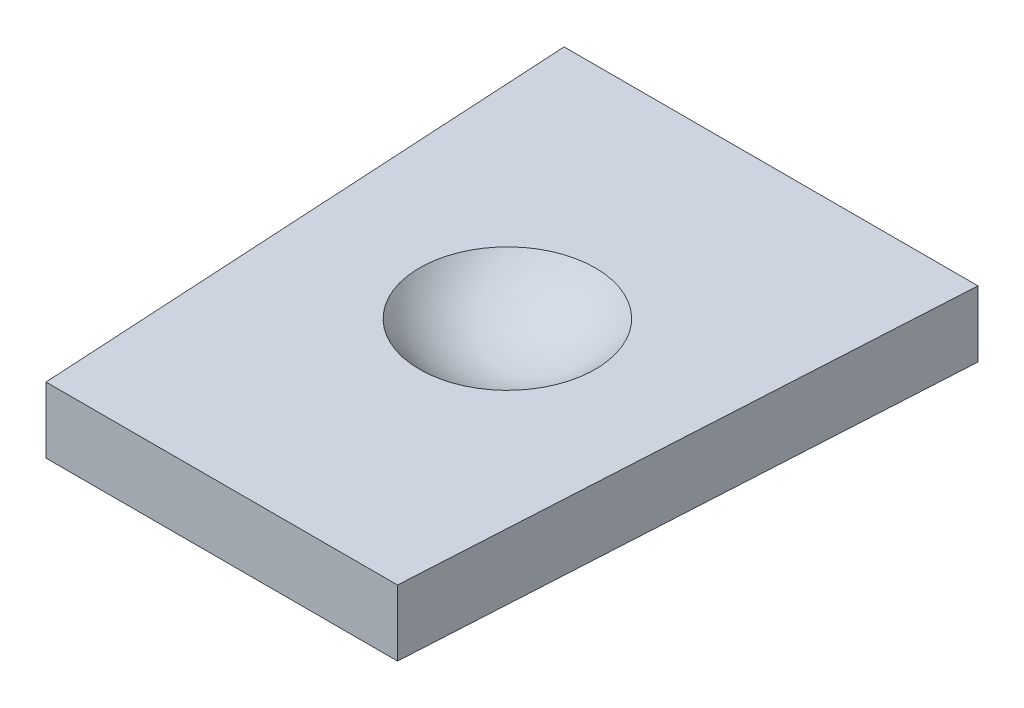
ISO-10303-21;
HEADER;
FILE_DESCRIPTION(('STEP AP214'),'2;1');
FILE_NAME('part.step','',(''),(''),'','','');
FILE_SCHEMA(('AUTOMOTIVE_DESIGN { 1 0 10303 214 1 1 1 1 }'));
ENDSEC;
DATA;
#1=APPLICATION_CONTEXT('core data for automotive mechanical design processes');
#2=APPLICATION_PROTOCOL_DEFINITION('international standard','automotive_design',2000,#1);
#3=PRODUCT_CONTEXT('',#1,'mechanical');
#4=PRODUCT('Part','Part','',(#3));
#5=PRODUCT_RELATED_PRODUCT_CATEGORY('part','',(#4));
#6=PRODUCT_DEFINITION_FORMATION('','',#4);
#7=PRODUCT_DEFINITION_CONTEXT('part definition',#1,'design');
#8=PRODUCT_DEFINITION('design','',#6,#7);
#9=PRODUCT_DEFINITION_SHAPE('','',#8);
#10=(LENGTH_UNIT() NAMED_UNIT(*) SI_UNIT(.MILLI.,.METRE.));
#11=(NAMED_UNIT(*) PLANE_ANGLE_UNIT() SI_UNIT($,.RADIAN.));
#12=(NAMED_UNIT(*) SI_UNIT($,.STERADIAN.) SOLID_ANGLE_UNIT());
#13=UNCERTAINTY_MEASURE_WITH_UNIT(LENGTH_MEASURE(1.E-05),#10,'distance_accuracy_value','');
#14=(GEOMETRIC_REPRESENTATION_CONTEXT(3) GLOBAL_UNCERTAINTY_ASSIGNED_CONTEXT((#13)) GLOBAL_UNIT_ASSIGNED_CONTEXT((#10,
#11,#12)) REPRESENTATION_CONTEXT('',''));
#15=CARTESIAN_POINT('',(0.,0.,0.));
#16=DIRECTION('',(0.,0.,1.));
#17=DIRECTION('',(1.,0.,0.));
#18=AXIS2_PLACEMENT_3D('',#15,#16,#17);
#19=CARTESIAN_POINT('',(-9.41960287819031,3.,-89.5));
#20=DIRECTION('',(0.,0.,1.));
#21=DIRECTION('',(1.,0.,0.));
#22=AXIS2_PLACEMENT_3D('',#19,#20,#21);
#23=PLANE('',#22);
#24=DIRECTION('',(-1.,0.,0.));
#25=VECTOR('',#24,1.);
#26=CARTESIAN_POINT('',(-9.41960287819031,0.,-89.5));
#27=LINE('',#26,#25);
#28=CARTESIAN_POINT('',(9.41960287819031,0.,-89.5));
#29=VERTEX_POINT('',#28);
#30=CARTESIAN_POINT('',(-9.41960287819031,0.,-89.5));
#31=VERTEX_POINT('',#30);
#32=EDGE_CURVE('E78',#29,#31,#27,.T.);
#33=ORIENTED_EDGE('',*,*,#32,.T.);
#34=DIRECTION('',(0.,-1.,0.));
#35=VECTOR('',#34,1.);
#36=CARTESIAN_POINT('',(-9.41960287819031,3.,-89.5));
#37=LINE('',#36,#35);
#38=CARTESIAN_POINT('',(-9.41960287819031,3.,-89.5));
#39=VERTEX_POINT('',#38);
#40=EDGE_CURVE('E11',#39,#31,#37,.T.);
#41=ORIENTED_EDGE('',*,*,#40,.F.);
#42=DIRECTION('',(-1.,0.,0.));
#43=VECTOR('',#42,1.);
#44=CARTESIAN_POINT('',(-9.41960287819031,3.,-89.5));
#45=LINE('',#44,#43);
#46=CARTESIAN_POINT('',(9.41960287819031,3.,-89.5));
#47=VERTEX_POINT('',#46);
#48=EDGE_CURVE('E69',#47,#39,#45,.T.);
#49=ORIENTED_EDGE('',*,*,#48,.F.);
#50=DIRECTION('',(0.,-1.,0.));
#51=VECTOR('',#50,1.);
#52=CARTESIAN_POINT('',(9.41960287819031,3.,-89.5));
#53=LINE('',#52,#51);
#54=EDGE_CURVE('E84',#47,#29,#53,.T.);
#55=ORIENTED_EDGE('',*,*,#54,.T.);
#56=EDGE_LOOP('',(#33,#41,#49,#55));
#57=FACE_BOUND('',#56,.T.);
#58=ADVANCED_FACE('F34',(#57),#23,.F.);
#59=CARTESIAN_POINT('',(-9.41960287819031,3.,-89.5));
#60=DIRECTION('',(0.998391670557349,0.,-0.0566927875633779));
#61=DIRECTION('',(-0.0566927875633779,0.,-0.998391670557349));
#62=AXIS2_PLACEMENT_3D('',#59,#60,#61);
#63=PLANE('',#62);
#64=DIRECTION('',(0.0566927875633779,0.,0.998391670557349));
#65=VECTOR('',#64,1.);
#66=CARTESIAN_POINT('',(-9.41960287819031,0.,-89.5));
#67=LINE('',#66,#65);
#68=CARTESIAN_POINT('',(-8.,0.,-64.5));
#69=VERTEX_POINT('',#68);
#70=EDGE_CURVE('E62',#31,#69,#67,.T.);
#71=ORIENTED_EDGE('',*,*,#70,.T.);
#72=DIRECTION('',(0.,-1.,0.));
#73=VECTOR('',#72,1.);
#74=CARTESIAN_POINT('',(-8.,3.,-64.5));
#75=LINE('',#74,#73);
#76=CARTESIAN_POINT('',(-8.,3.,-64.5));
#77=VERTEX_POINT('',#76);
#78=EDGE_CURVE('E43',#77,#69,#75,.T.);
#79=ORIENTED_EDGE('',*,*,#78,.F.);
#80=DIRECTION('',(0.0566927875633779,0.,0.998391670557349));
#81=VECTOR('',#80,1.);
#82=CARTESIAN_POINT('',(-9.41960287819031,3.,-89.5));
#83=LINE('',#82,#81);
#84=EDGE_CURVE('E51',#39,#77,#83,.T.);
#85=ORIENTED_EDGE('',*,*,#84,.F.);
#86=ORIENTED_EDGE('',*,*,#40,.T.);
#87=EDGE_LOOP('',(#71,#79,#85,#86));
#88=FACE_BOUND('',#87,.T.);
#89=ADVANCED_FACE('F110',(#88),#63,.F.);
#90=CARTESIAN_POINT('',(0.,3.,-64.5));
#91=DIRECTION('',(0.,0.,-1.));
#92=DIRECTION('',(-1.,0.,0.));
#93=AXIS2_PLACEMENT_3D('',#90,#91,#92);
#94=PLANE('',#93);
#95=DIRECTION('',(1.,0.,0.));
#96=VECTOR('',#95,1.);
#97=CARTESIAN_POINT('',(0.,0.,-64.5));
#98=LINE('',#97,#96);
#99=CARTESIAN_POINT('',(8.,0.,-64.5));
#100=VERTEX_POINT('',#99);
#101=EDGE_CURVE('E99',#69,#100,#98,.T.);
#102=ORIENTED_EDGE('',*,*,#101,.T.);
#103=DIRECTION('',(0.,-1.,0.));
#104=VECTOR('',#103,1.);
#105=CARTESIAN_POINT('',(8.,3.,-64.5));
#106=LINE('',#105,#104);
#107=CARTESIAN_POINT('',(8.,3.,-64.5));
#108=VERTEX_POINT('',#107);
#109=EDGE_CURVE('E82',#108,#100,#106,.T.);
#110=ORIENTED_EDGE('',*,*,#109,.F.);
#111=DIRECTION('',(1.,0.,0.));
#112=VECTOR('',#111,1.);
#113=CARTESIAN_POINT('',(0.,3.,-64.5));
#114=LINE('',#113,#112);
#115=EDGE_CURVE('E101',#77,#108,#114,.T.);
#116=ORIENTED_EDGE('',*,*,#115,.F.);
#117=ORIENTED_EDGE('',*,*,#78,.T.);
#118=EDGE_LOOP('',(#102,#110,#116,#117));
#119=FACE_BOUND('',#118,.T.);
#120=ADVANCED_FACE('F108',(#119),#94,.F.);
#121=CARTESIAN_POINT('',(0.,3.,0.));
#122=DIRECTION('',(0.,-1.,0.));
#123=DIRECTION('',(0.,0.,-1.));
#124=AXIS2_PLACEMENT_3D('',#121,#122,#123);
#125=PLANE('',#124);
#126=CARTESIAN_POINT('',(0.,3.,-77.5));
#127=DIRECTION('',(0.,-1.,0.));
#128=DIRECTION('',(0.,0.,-1.));
#129=AXIS2_PLACEMENT_3D('',#126,#127,#128);
#130=CIRCLE('',#129,4.);
#131=CARTESIAN_POINT('',(0.,3.,-81.5));
#132=VERTEX_POINT('',#131);
#133=EDGE_CURVE('E37',#132,#132,#130,.T.);
#134=ORIENTED_EDGE('',*,*,#133,.T.);
#135=EDGE_LOOP('',(#134));
#136=FACE_BOUND('',#135,.T.);
#137=ORIENTED_EDGE('',*,*,#48,.T.);
#138=ORIENTED_EDGE('',*,*,#84,.T.);
#139=ORIENTED_EDGE('',*,*,#115,.T.);
#140=DIRECTION('',(-0.0566927875633779,0.,0.998391670557349));
#141=VECTOR('',#140,1.);
#142=CARTESIAN_POINT('',(9.41960287819031,3.,-89.5));
#143=LINE('',#142,#141);
#144=EDGE_CURVE('E88',#47,#108,#143,.T.);
#145=ORIENTED_EDGE('',*,*,#144,.F.);
#146=EDGE_LOOP('',(#137,#138,#139,#145));
#147=FACE_BOUND('',#146,.T.);
#148=ADVANCED_FACE('F111',(#136,#147),#125,.F.);
#149=CARTESIAN_POINT('',(0.,0.,0.));
#150=DIRECTION('',(0.,-1.,0.));
#151=DIRECTION('',(0.,0.,-1.));
#152=AXIS2_PLACEMENT_3D('',#149,#150,#151);
#153=PLANE('',#152);
#154=ORIENTED_EDGE('',*,*,#32,.F.);
#155=DIRECTION('',(-0.0566927875633779,0.,0.998391670557349));
#156=VECTOR('',#155,1.);
#157=CARTESIAN_POINT('',(9.41960287819031,0.,-89.5));
#158=LINE('',#157,#156);
#159=EDGE_CURVE('E81',#29,#100,#158,.T.);
#160=ORIENTED_EDGE('',*,*,#159,.T.);
#161=ORIENTED_EDGE('',*,*,#101,.F.);
#162=ORIENTED_EDGE('',*,*,#70,.F.);
#163=EDGE_LOOP('',(#154,#160,#161,#162));
#164=FACE_BOUND('',#163,.T.);
#165=ADVANCED_FACE('F79',(#164),#153,.T.);
#166=CARTESIAN_POINT('',(9.41960287819031,3.,-89.5));
#167=DIRECTION('',(0.998391670557349,0.,0.0566927875633779));
#168=DIRECTION('',(0.0566927875633779,0.,-0.998391670557349));
#169=AXIS2_PLACEMENT_3D('',#166,#167,#168);
#170=PLANE('',#169);
#171=ORIENTED_EDGE('',*,*,#159,.F.);
#172=ORIENTED_EDGE('',*,*,#54,.F.);
#173=ORIENTED_EDGE('',*,*,#144,.T.);
#174=ORIENTED_EDGE('',*,*,#109,.T.);
#175=EDGE_LOOP('',(#171,#172,#173,#174));
#176=FACE_BOUND('',#175,.T.);
#177=ADVANCED_FACE('F91',(#176),#170,.T.);
#178=CARTESIAN_POINT('',(0.,6.,-77.5));
#179=DIRECTION('',(0.,1.,0.));
#180=DIRECTION('',(0.,0.,1.));
#181=AXIS2_PLACEMENT_3D('',#178,#179,#180);
#182=SPHERICAL_SURFACE('',#181,5.);
#183=ORIENTED_EDGE('',*,*,#133,.F.);
#184=EDGE_LOOP('',(#183));
#185=FACE_BOUND('',#184,.T.);
#186=ADVANCED_FACE('F148',(#185),#182,.F.);
#187=CLOSED_SHELL('',(#58,#89,#120,#148,#165,#177,#186));
#188=MANIFOLD_SOLID_BREP('B2',#187);
#189=ADVANCED_BREP_SHAPE_REPRESENTATION('',(#18,#188),#14);
#190=SHAPE_DEFINITION_REPRESENTATION(#9,#189);
ENDSEC;
END-ISO-10303-21;
